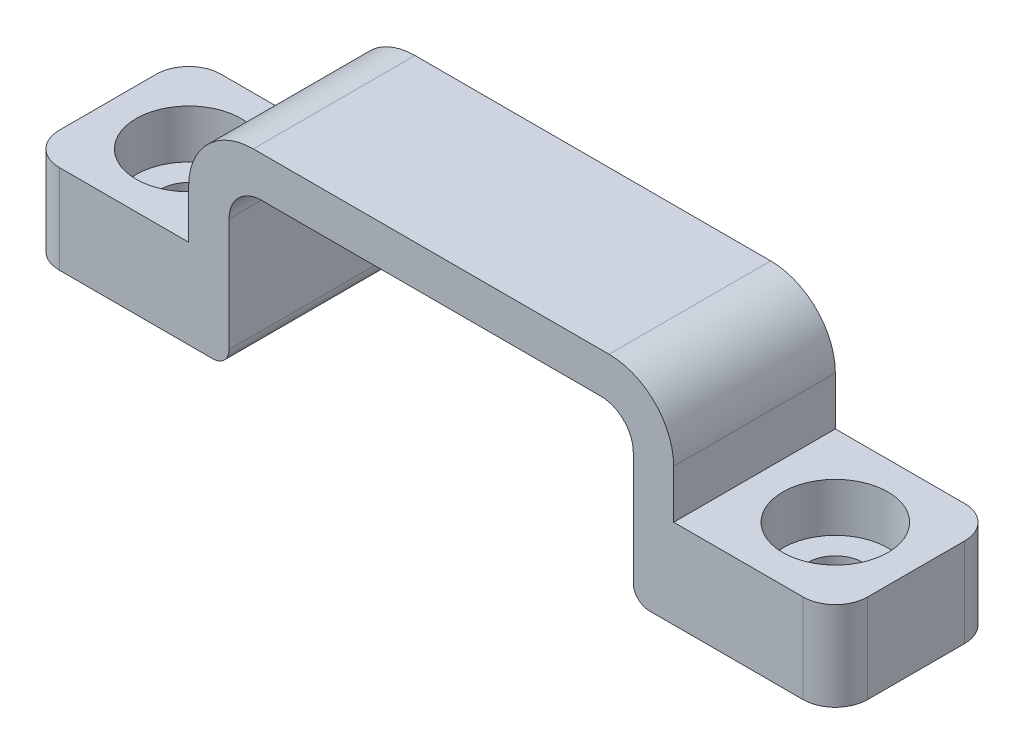
ISO-10303-21;
HEADER;
FILE_DESCRIPTION(('STEP AP214'),'2;1');
FILE_NAME('part.step','',(''),(''),'','','');
FILE_SCHEMA(('AUTOMOTIVE_DESIGN { 1 0 10303 214 1 1 1 1 }'));
ENDSEC;
DATA;
#1=APPLICATION_CONTEXT('core data for automotive mechanical design processes');
#2=APPLICATION_PROTOCOL_DEFINITION('international standard','automotive_design',2000,#1);
#3=PRODUCT_CONTEXT('',#1,'mechanical');
#4=PRODUCT('Part','Part','',(#3));
#5=PRODUCT_RELATED_PRODUCT_CATEGORY('part','',(#4));
#6=PRODUCT_DEFINITION_FORMATION('','',#4);
#7=PRODUCT_DEFINITION_CONTEXT('part definition',#1,'design');
#8=PRODUCT_DEFINITION('design','',#6,#7);
#9=PRODUCT_DEFINITION_SHAPE('','',#8);
#10=(LENGTH_UNIT() NAMED_UNIT(*) SI_UNIT(.MILLI.,.METRE.));
#11=(NAMED_UNIT(*) PLANE_ANGLE_UNIT() SI_UNIT($,.RADIAN.));
#12=(NAMED_UNIT(*) SI_UNIT($,.STERADIAN.) SOLID_ANGLE_UNIT());
#13=UNCERTAINTY_MEASURE_WITH_UNIT(LENGTH_MEASURE(1.E-05),#10,'distance_accuracy_value','');
#14=(GEOMETRIC_REPRESENTATION_CONTEXT(3) GLOBAL_UNCERTAINTY_ASSIGNED_CONTEXT((#13)) GLOBAL_UNIT_ASSIGNED_CONTEXT((#10,
#11,#12)) REPRESENTATION_CONTEXT('',''));
#15=CARTESIAN_POINT('',(0.,0.,0.));
#16=DIRECTION('',(0.,0.,1.));
#17=DIRECTION('',(1.,0.,0.));
#18=AXIS2_PLACEMENT_3D('',#15,#16,#17);
#19=CARTESIAN_POINT('',(15.,2.5,5.));
#20=DIRECTION('',(-1.,0.,0.));
#21=DIRECTION('',(0.,0.,1.));
#22=AXIS2_PLACEMENT_3D('',#19,#20,#21);
#23=PLANE('',#22);
#24=DIRECTION('',(0.,1.,0.));
#25=VECTOR('',#24,1.);
#26=CARTESIAN_POINT('',(15.,2.5,-5.));
#27=LINE('',#26,#25);
#28=CARTESIAN_POINT('',(15.,-4.5,-5.));
#29=VERTEX_POINT('',#28);
#30=CARTESIAN_POINT('',(15.,-1.5,-5.));
#31=VERTEX_POINT('',#30);
#32=EDGE_CURVE('E237',#29,#31,#27,.T.);
#33=ORIENTED_EDGE('',*,*,#32,.T.);
#34=DIRECTION('',(0.,0.,-1.));
#35=VECTOR('',#34,1.);
#36=CARTESIAN_POINT('',(15.,-1.5,5.));
#37=LINE('',#36,#35);
#38=CARTESIAN_POINT('',(15.,-1.5,5.));
#39=VERTEX_POINT('',#38);
#40=EDGE_CURVE('E308',#31,#39,#37,.F.);
#41=ORIENTED_EDGE('',*,*,#40,.T.);
#42=DIRECTION('',(0.,1.,0.));
#43=VECTOR('',#42,1.);
#44=CARTESIAN_POINT('',(15.,2.5,5.));
#45=LINE('',#44,#43);
#46=CARTESIAN_POINT('',(15.,-4.5,5.));
#47=VERTEX_POINT('',#46);
#48=EDGE_CURVE('E261',#47,#39,#45,.T.);
#49=ORIENTED_EDGE('',*,*,#48,.F.);
#50=DIRECTION('',(0.,0.,-1.));
#51=VECTOR('',#50,1.);
#52=CARTESIAN_POINT('',(15.,-4.5,5.));
#53=LINE('',#52,#51);
#54=EDGE_CURVE('E236',#47,#29,#53,.T.);
#55=ORIENTED_EDGE('',*,*,#54,.T.);
#56=EDGE_LOOP('',(#33,#41,#49,#55));
#57=FACE_BOUND('',#56,.T.);
#58=ADVANCED_FACE('F41',(#57),#23,.F.);
#59=CARTESIAN_POINT('',(-15.,2.5,5.));
#60=DIRECTION('',(0.,-1.,0.));
#61=DIRECTION('',(0.,0.,-1.));
#62=AXIS2_PLACEMENT_3D('',#59,#60,#61);
#63=PLANE('',#62);
#64=DIRECTION('',(-1.,0.,0.));
#65=VECTOR('',#64,1.);
#66=CARTESIAN_POINT('',(-15.,2.5,-5.));
#67=LINE('',#66,#65);
#68=CARTESIAN_POINT('',(11.,2.5,-5.));
#69=VERTEX_POINT('',#68);
#70=CARTESIAN_POINT('',(-11.,2.5,-5.));
#71=VERTEX_POINT('',#70);
#72=EDGE_CURVE('E240',#69,#71,#67,.T.);
#73=ORIENTED_EDGE('',*,*,#72,.T.);
#74=DIRECTION('',(0.,0.,-1.));
#75=VECTOR('',#74,1.);
#76=CARTESIAN_POINT('',(-11.,2.5,5.));
#77=LINE('',#76,#75);
#78=CARTESIAN_POINT('',(-11.,2.5,5.));
#79=VERTEX_POINT('',#78);
#80=EDGE_CURVE('E303',#71,#79,#77,.F.);
#81=ORIENTED_EDGE('',*,*,#80,.T.);
#82=DIRECTION('',(-1.,0.,0.));
#83=VECTOR('',#82,1.);
#84=CARTESIAN_POINT('',(-15.,2.5,5.));
#85=LINE('',#84,#83);
#86=CARTESIAN_POINT('',(11.,2.5,5.));
#87=VERTEX_POINT('',#86);
#88=EDGE_CURVE('E203',#87,#79,#85,.T.);
#89=ORIENTED_EDGE('',*,*,#88,.F.);
#90=DIRECTION('',(0.,0.,-1.));
#91=VECTOR('',#90,1.);
#92=CARTESIAN_POINT('',(11.,2.5,5.));
#93=LINE('',#92,#91);
#94=EDGE_CURVE('E300',#87,#69,#93,.T.);
#95=ORIENTED_EDGE('',*,*,#94,.T.);
#96=EDGE_LOOP('',(#73,#81,#89,#95));
#97=FACE_BOUND('',#96,.T.);
#98=ADVANCED_FACE('F432',(#97),#63,.F.);
#99=CARTESIAN_POINT('',(-15.,2.5,5.));
#100=DIRECTION('',(1.,0.,0.));
#101=DIRECTION('',(0.,0.,-1.));
#102=AXIS2_PLACEMENT_3D('',#99,#100,#101);
#103=PLANE('',#102);
#104=DIRECTION('',(0.,-1.,0.));
#105=VECTOR('',#104,1.);
#106=CARTESIAN_POINT('',(-15.,2.5,5.));
#107=LINE('',#106,#105);
#108=CARTESIAN_POINT('',(-15.,-1.5,5.));
#109=VERTEX_POINT('',#108);
#110=CARTESIAN_POINT('',(-15.,-4.5,5.));
#111=VERTEX_POINT('',#110);
#112=EDGE_CURVE('E189',#109,#111,#107,.T.);
#113=ORIENTED_EDGE('',*,*,#112,.F.);
#114=DIRECTION('',(0.,0.,-1.));
#115=VECTOR('',#114,1.);
#116=CARTESIAN_POINT('',(-15.,-1.5,5.));
#117=LINE('',#116,#115);
#118=CARTESIAN_POINT('',(-15.,-1.5,-5.));
#119=VERTEX_POINT('',#118);
#120=EDGE_CURVE('E294',#109,#119,#117,.T.);
#121=ORIENTED_EDGE('',*,*,#120,.T.);
#122=DIRECTION('',(0.,-1.,0.));
#123=VECTOR('',#122,1.);
#124=CARTESIAN_POINT('',(-15.,2.5,-5.));
#125=LINE('',#124,#123);
#126=CARTESIAN_POINT('',(-15.,-4.5,-5.));
#127=VERTEX_POINT('',#126);
#128=EDGE_CURVE('E209',#119,#127,#125,.T.);
#129=ORIENTED_EDGE('',*,*,#128,.T.);
#130=DIRECTION('',(0.,0.,-1.));
#131=VECTOR('',#130,1.);
#132=CARTESIAN_POINT('',(-15.,-4.5,5.));
#133=LINE('',#132,#131);
#134=EDGE_CURVE('E206',#111,#127,#133,.T.);
#135=ORIENTED_EDGE('',*,*,#134,.F.);
#136=EDGE_LOOP('',(#113,#121,#129,#135));
#137=FACE_BOUND('',#136,.T.);
#138=ADVANCED_FACE('F207',(#137),#103,.F.);
#139=CARTESIAN_POINT('',(-15.,-4.5,5.));
#140=DIRECTION('',(0.,-1.,0.));
#141=DIRECTION('',(1.,0.,0.));
#142=AXIS2_PLACEMENT_3D('',#139,#140,#141);
#143=PLANE('',#142);
#144=CARTESIAN_POINT('',(-20.,-4.5,0.));
#145=DIRECTION('',(0.,1.,0.));
#146=DIRECTION('',(0.,0.,1.));
#147=AXIS2_PLACEMENT_3D('',#144,#145,#146);
#148=CIRCLE('',#147,3.25);
#149=CARTESIAN_POINT('',(-20.,-4.5,3.25));
#150=VERTEX_POINT('',#149);
#151=EDGE_CURVE('E414',#150,#150,#148,.T.);
#152=ORIENTED_EDGE('',*,*,#151,.F.);
#153=EDGE_LOOP('',(#152));
#154=FACE_BOUND('',#153,.T.);
#155=DIRECTION('',(-1.,0.,0.));
#156=VECTOR('',#155,1.);
#157=CARTESIAN_POINT('',(-15.,-4.5,-5.));
#158=LINE('',#157,#156);
#159=CARTESIAN_POINT('',(-23.,-4.5,-5.));
#160=VERTEX_POINT('',#159);
#161=EDGE_CURVE('E245',#127,#160,#158,.T.);
#162=ORIENTED_EDGE('',*,*,#161,.T.);
#163=CARTESIAN_POINT('',(-23.,-4.5,-3.));
#164=DIRECTION('',(0.,-1.,0.));
#165=DIRECTION('',(1.,0.,0.));
#166=AXIS2_PLACEMENT_3D('',#163,#164,#165);
#167=CIRCLE('',#166,2.);
#168=CARTESIAN_POINT('',(-25.,-4.5,-3.));
#169=VERTEX_POINT('',#168);
#170=EDGE_CURVE('E325',#160,#169,#167,.F.);
#171=ORIENTED_EDGE('',*,*,#170,.T.);
#172=DIRECTION('',(0.,0.,-1.));
#173=VECTOR('',#172,1.);
#174=CARTESIAN_POINT('',(-25.,-4.5,5.));
#175=LINE('',#174,#173);
#176=CARTESIAN_POINT('',(-25.,-4.5,3.));
#177=VERTEX_POINT('',#176);
#178=EDGE_CURVE('E214',#177,#169,#175,.T.);
#179=ORIENTED_EDGE('',*,*,#178,.F.);
#180=CARTESIAN_POINT('',(-23.,-4.5,3.));
#181=DIRECTION('',(0.,-1.,0.));
#182=DIRECTION('',(1.,0.,0.));
#183=AXIS2_PLACEMENT_3D('',#180,#181,#182);
#184=CIRCLE('',#183,2.);
#185=CARTESIAN_POINT('',(-23.,-4.5,5.));
#186=VERTEX_POINT('',#185);
#187=EDGE_CURVE('E219',#177,#186,#184,.F.);
#188=ORIENTED_EDGE('',*,*,#187,.T.);
#189=DIRECTION('',(-1.,0.,0.));
#190=VECTOR('',#189,1.);
#191=CARTESIAN_POINT('',(-15.,-4.5,5.));
#192=LINE('',#191,#190);
#193=EDGE_CURVE('E195',#111,#186,#192,.T.);
#194=ORIENTED_EDGE('',*,*,#193,.F.);
#195=ORIENTED_EDGE('',*,*,#134,.T.);
#196=EDGE_LOOP('',(#162,#171,#179,#188,#194,#195));
#197=FACE_BOUND('',#196,.T.);
#198=ADVANCED_FACE('F216',(#154,#197),#143,.F.);
#199=CARTESIAN_POINT('',(-25.,-4.5,5.));
#200=DIRECTION('',(1.,0.,0.));
#201=DIRECTION('',(0.,0.,-1.));
#202=AXIS2_PLACEMENT_3D('',#199,#200,#201);
#203=PLANE('',#202);
#204=ORIENTED_EDGE('',*,*,#178,.T.);
#205=DIRECTION('',(0.,-1.,0.));
#206=VECTOR('',#205,1.);
#207=CARTESIAN_POINT('',(-25.,-4.5,-3.));
#208=LINE('',#207,#206);
#209=CARTESIAN_POINT('',(-25.,-10.,-3.));
#210=VERTEX_POINT('',#209);
#211=EDGE_CURVE('E312',#169,#210,#208,.T.);
#212=ORIENTED_EDGE('',*,*,#211,.T.);
#213=DIRECTION('',(0.,0.,-1.));
#214=VECTOR('',#213,1.);
#215=CARTESIAN_POINT('',(-25.,-10.,5.));
#216=LINE('',#215,#214);
#217=CARTESIAN_POINT('',(-25.,-10.,3.));
#218=VERTEX_POINT('',#217);
#219=EDGE_CURVE('E270',#218,#210,#216,.T.);
#220=ORIENTED_EDGE('',*,*,#219,.F.);
#221=DIRECTION('',(0.,-1.,0.));
#222=VECTOR('',#221,1.);
#223=CARTESIAN_POINT('',(-25.,-4.5,3.));
#224=LINE('',#223,#222);
#225=EDGE_CURVE('E310',#218,#177,#224,.F.);
#226=ORIENTED_EDGE('',*,*,#225,.T.);
#227=EDGE_LOOP('',(#204,#212,#220,#226));
#228=FACE_BOUND('',#227,.T.);
#229=ADVANCED_FACE('F421',(#228),#203,.F.);
#230=CARTESIAN_POINT('',(-15.,-10.,5.));
#231=DIRECTION('',(0.,1.,0.));
#232=DIRECTION('',(-1.,0.,0.));
#233=AXIS2_PLACEMENT_3D('',#230,#231,#232);
#234=PLANE('',#233);
#235=CARTESIAN_POINT('',(-20.,-10.,0.));
#236=DIRECTION('',(0.,1.,0.));
#237=DIRECTION('',(0.,0.,1.));
#238=AXIS2_PLACEMENT_3D('',#235,#236,#237);
#239=CIRCLE('',#238,1.7);
#240=CARTESIAN_POINT('',(-20.,-10.,1.7));
#241=VERTEX_POINT('',#240);
#242=EDGE_CURVE('E405',#241,#241,#239,.T.);
#243=ORIENTED_EDGE('',*,*,#242,.T.);
#244=EDGE_LOOP('',(#243));
#245=FACE_BOUND('',#244,.T.);
#246=DIRECTION('',(1.,0.,0.));
#247=VECTOR('',#246,1.);
#248=CARTESIAN_POINT('',(-15.,-10.,-5.));
#249=LINE('',#248,#247);
#250=CARTESIAN_POINT('',(-23.,-9.99999999999999,-5.));
#251=VERTEX_POINT('',#250);
#252=CARTESIAN_POINT('',(-13.5,-10.,-5.));
#253=VERTEX_POINT('',#252);
#254=EDGE_CURVE('E247',#251,#253,#249,.T.);
#255=ORIENTED_EDGE('',*,*,#254,.T.);
#256=DIRECTION('',(0.,0.,-1.));
#257=VECTOR('',#256,1.);
#258=CARTESIAN_POINT('',(-13.5,-10.,5.));
#259=LINE('',#258,#257);
#260=CARTESIAN_POINT('',(-13.5,-10.,5.));
#261=VERTEX_POINT('',#260);
#262=EDGE_CURVE('E353',#253,#261,#259,.F.);
#263=ORIENTED_EDGE('',*,*,#262,.T.);
#264=DIRECTION('',(1.,0.,0.));
#265=VECTOR('',#264,1.);
#266=CARTESIAN_POINT('',(-15.,-10.,5.));
#267=LINE('',#266,#265);
#268=CARTESIAN_POINT('',(-23.,-10.,5.));
#269=VERTEX_POINT('',#268);
#270=EDGE_CURVE('E220',#269,#261,#267,.T.);
#271=ORIENTED_EDGE('',*,*,#270,.F.);
#272=CARTESIAN_POINT('',(-23.,-9.99999999999999,3.));
#273=DIRECTION('',(0.,1.,0.));
#274=DIRECTION('',(-1.,0.,0.));
#275=AXIS2_PLACEMENT_3D('',#272,#273,#274);
#276=CIRCLE('',#275,2.);
#277=EDGE_CURVE('E315',#269,#218,#276,.F.);
#278=ORIENTED_EDGE('',*,*,#277,.T.);
#279=ORIENTED_EDGE('',*,*,#219,.T.);
#280=CARTESIAN_POINT('',(-23.,-9.99999999999999,-3.));
#281=DIRECTION('',(0.,1.,0.));
#282=DIRECTION('',(-1.,0.,0.));
#283=AXIS2_PLACEMENT_3D('',#280,#281,#282);
#284=CIRCLE('',#283,2.);
#285=EDGE_CURVE('E317',#210,#251,#284,.F.);
#286=ORIENTED_EDGE('',*,*,#285,.T.);
#287=EDGE_LOOP('',(#255,#263,#271,#278,#279,#286));
#288=FACE_BOUND('',#287,.T.);
#289=ADVANCED_FACE('F428',(#245,#288),#234,.F.);
#290=CARTESIAN_POINT('',(-12.5,-10.,5.));
#291=DIRECTION('',(-1.,0.,0.));
#292=DIRECTION('',(0.,0.,1.));
#293=AXIS2_PLACEMENT_3D('',#290,#291,#292);
#294=PLANE('',#293);
#295=DIRECTION('',(0.,1.,0.));
#296=VECTOR('',#295,1.);
#297=CARTESIAN_POINT('',(-12.5,-10.,5.));
#298=LINE('',#297,#296);
#299=CARTESIAN_POINT('',(-12.5,-9.,5.));
#300=VERTEX_POINT('',#299);
#301=CARTESIAN_POINT('',(-12.5,-2.,5.));
#302=VERTEX_POINT('',#301);
#303=EDGE_CURVE('E222',#300,#302,#298,.T.);
#304=ORIENTED_EDGE('',*,*,#303,.F.);
#305=DIRECTION('',(0.,0.,-1.));
#306=VECTOR('',#305,1.);
#307=CARTESIAN_POINT('',(-12.5,-9.,5.));
#308=LINE('',#307,#306);
#309=CARTESIAN_POINT('',(-12.5,-9.,-5.));
#310=VERTEX_POINT('',#309);
#311=EDGE_CURVE('E346',#300,#310,#308,.T.);
#312=ORIENTED_EDGE('',*,*,#311,.T.);
#313=DIRECTION('',(0.,1.,0.));
#314=VECTOR('',#313,1.);
#315=CARTESIAN_POINT('',(-12.5,-10.,-5.));
#316=LINE('',#315,#314);
#317=CARTESIAN_POINT('',(-12.5,-2.,-5.));
#318=VERTEX_POINT('',#317);
#319=EDGE_CURVE('E250',#310,#318,#316,.T.);
#320=ORIENTED_EDGE('',*,*,#319,.T.);
#321=DIRECTION('',(0.,0.,-1.));
#322=VECTOR('',#321,1.);
#323=CARTESIAN_POINT('',(-12.5,-2.,5.));
#324=LINE('',#323,#322);
#325=EDGE_CURVE('E279',#318,#302,#324,.F.);
#326=ORIENTED_EDGE('',*,*,#325,.T.);
#327=EDGE_LOOP('',(#304,#312,#320,#326));
#328=FACE_BOUND('',#327,.T.);
#329=ADVANCED_FACE('F482',(#328),#294,.F.);
#330=CARTESIAN_POINT('',(-12.5,0.,5.));
#331=DIRECTION('',(0.,1.,0.));
#332=DIRECTION('',(0.,0.,1.));
#333=AXIS2_PLACEMENT_3D('',#330,#331,#332);
#334=PLANE('',#333);
#335=DIRECTION('',(1.,0.,0.));
#336=VECTOR('',#335,1.);
#337=CARTESIAN_POINT('',(-12.5,0.,5.));
#338=LINE('',#337,#336);
#339=CARTESIAN_POINT('',(-10.5,0.,5.));
#340=VERTEX_POINT('',#339);
#341=CARTESIAN_POINT('',(10.5,0.,5.));
#342=VERTEX_POINT('',#341);
#343=EDGE_CURVE('E227',#340,#342,#338,.T.);
#344=ORIENTED_EDGE('',*,*,#343,.F.);
#345=DIRECTION('',(0.,0.,-1.));
#346=VECTOR('',#345,1.);
#347=CARTESIAN_POINT('',(-10.5,0.,-5.));
#348=LINE('',#347,#346);
#349=CARTESIAN_POINT('',(-10.5,0.,-5.));
#350=VERTEX_POINT('',#349);
#351=EDGE_CURVE('E276',#340,#350,#348,.T.);
#352=ORIENTED_EDGE('',*,*,#351,.T.);
#353=DIRECTION('',(1.,0.,0.));
#354=VECTOR('',#353,1.);
#355=CARTESIAN_POINT('',(-12.5,0.,-5.));
#356=LINE('',#355,#354);
#357=CARTESIAN_POINT('',(10.5,0.,-5.));
#358=VERTEX_POINT('',#357);
#359=EDGE_CURVE('E252',#350,#358,#356,.T.);
#360=ORIENTED_EDGE('',*,*,#359,.T.);
#361=DIRECTION('',(0.,0.,-1.));
#362=VECTOR('',#361,1.);
#363=CARTESIAN_POINT('',(10.5,0.,5.));
#364=LINE('',#363,#362);
#365=EDGE_CURVE('E213',#358,#342,#364,.F.);
#366=ORIENTED_EDGE('',*,*,#365,.T.);
#367=EDGE_LOOP('',(#344,#352,#360,#366));
#368=FACE_BOUND('',#367,.T.);
#369=ADVANCED_FACE('F489',(#368),#334,.F.);
#370=CARTESIAN_POINT('',(12.5,-10.,5.));
#371=DIRECTION('',(1.,0.,0.));
#372=DIRECTION('',(0.,0.,-1.));
#373=AXIS2_PLACEMENT_3D('',#370,#371,#372);
#374=PLANE('',#373);
#375=DIRECTION('',(0.,-1.,0.));
#376=VECTOR('',#375,1.);
#377=CARTESIAN_POINT('',(12.5,-10.,-5.));
#378=LINE('',#377,#376);
#379=CARTESIAN_POINT('',(12.5,-2.,-5.));
#380=VERTEX_POINT('',#379);
#381=CARTESIAN_POINT('',(12.5,-9.,-5.));
#382=VERTEX_POINT('',#381);
#383=EDGE_CURVE('E255',#380,#382,#378,.T.);
#384=ORIENTED_EDGE('',*,*,#383,.T.);
#385=DIRECTION('',(0.,0.,-1.));
#386=VECTOR('',#385,1.);
#387=CARTESIAN_POINT('',(12.5,-9.,5.));
#388=LINE('',#387,#386);
#389=CARTESIAN_POINT('',(12.5,-9.,5.));
#390=VERTEX_POINT('',#389);
#391=EDGE_CURVE('E11',#382,#390,#388,.F.);
#392=ORIENTED_EDGE('',*,*,#391,.T.);
#393=DIRECTION('',(0.,-1.,0.));
#394=VECTOR('',#393,1.);
#395=CARTESIAN_POINT('',(12.5,-10.,5.));
#396=LINE('',#395,#394);
#397=CARTESIAN_POINT('',(12.5,-2.,5.));
#398=VERTEX_POINT('',#397);
#399=EDGE_CURVE('E230',#398,#390,#396,.T.);
#400=ORIENTED_EDGE('',*,*,#399,.F.);
#401=DIRECTION('',(0.,0.,-1.));
#402=VECTOR('',#401,1.);
#403=CARTESIAN_POINT('',(12.5,-2.,-5.));
#404=LINE('',#403,#402);
#405=EDGE_CURVE('E282',#398,#380,#404,.T.);
#406=ORIENTED_EDGE('',*,*,#405,.T.);
#407=EDGE_LOOP('',(#384,#392,#400,#406));
#408=FACE_BOUND('',#407,.T.);
#409=ADVANCED_FACE('F493',(#408),#374,.F.);
#410=CARTESIAN_POINT('',(15.,-10.,5.));
#411=DIRECTION('',(0.,1.,0.));
#412=DIRECTION('',(-1.,0.,0.));
#413=AXIS2_PLACEMENT_3D('',#410,#411,#412);
#414=PLANE('',#413);
#415=CARTESIAN_POINT('',(20.,-10.,0.));
#416=DIRECTION('',(0.,1.,0.));
#417=DIRECTION('',(0.,0.,1.));
#418=AXIS2_PLACEMENT_3D('',#415,#416,#417);
#419=CIRCLE('',#418,1.7);
#420=CARTESIAN_POINT('',(20.,-10.,1.7));
#421=VERTEX_POINT('',#420);
#422=EDGE_CURVE('E241',#421,#421,#419,.T.);
#423=ORIENTED_EDGE('',*,*,#422,.T.);
#424=EDGE_LOOP('',(#423));
#425=FACE_BOUND('',#424,.T.);
#426=DIRECTION('',(1.,0.,0.));
#427=VECTOR('',#426,1.);
#428=CARTESIAN_POINT('',(15.,-10.,5.));
#429=LINE('',#428,#427);
#430=CARTESIAN_POINT('',(13.5,-10.,5.));
#431=VERTEX_POINT('',#430);
#432=CARTESIAN_POINT('',(23.,-9.99999999999999,5.));
#433=VERTEX_POINT('',#432);
#434=EDGE_CURVE('E232',#431,#433,#429,.T.);
#435=ORIENTED_EDGE('',*,*,#434,.F.);
#436=DIRECTION('',(0.,0.,-1.));
#437=VECTOR('',#436,1.);
#438=CARTESIAN_POINT('',(13.5,-10.,5.));
#439=LINE('',#438,#437);
#440=CARTESIAN_POINT('',(13.5,-10.,-5.));
#441=VERTEX_POINT('',#440);
#442=EDGE_CURVE('E49',#431,#441,#439,.T.);
#443=ORIENTED_EDGE('',*,*,#442,.T.);
#444=DIRECTION('',(1.,0.,0.));
#445=VECTOR('',#444,1.);
#446=CARTESIAN_POINT('',(15.,-10.,-5.));
#447=LINE('',#446,#445);
#448=CARTESIAN_POINT('',(23.,-10.,-5.));
#449=VERTEX_POINT('',#448);
#450=EDGE_CURVE('E257',#441,#449,#447,.T.);
#451=ORIENTED_EDGE('',*,*,#450,.T.);
#452=CARTESIAN_POINT('',(23.,-10.,-3.));
#453=DIRECTION('',(0.,1.,0.));
#454=DIRECTION('',(-1.,0.,0.));
#455=AXIS2_PLACEMENT_3D('',#452,#453,#454);
#456=CIRCLE('',#455,2.);
#457=CARTESIAN_POINT('',(25.,-10.,-3.));
#458=VERTEX_POINT('',#457);
#459=EDGE_CURVE('E344',#449,#458,#456,.F.);
#460=ORIENTED_EDGE('',*,*,#459,.T.);
#461=DIRECTION('',(0.,0.,-1.));
#462=VECTOR('',#461,1.);
#463=CARTESIAN_POINT('',(25.,-10.,5.));
#464=LINE('',#463,#462);
#465=CARTESIAN_POINT('',(25.,-10.,3.));
#466=VERTEX_POINT('',#465);
#467=EDGE_CURVE('E267',#466,#458,#464,.T.);
#468=ORIENTED_EDGE('',*,*,#467,.F.);
#469=CARTESIAN_POINT('',(23.,-10.,3.));
#470=DIRECTION('',(0.,1.,0.));
#471=DIRECTION('',(-1.,0.,0.));
#472=AXIS2_PLACEMENT_3D('',#469,#470,#471);
#473=CIRCLE('',#472,2.);
#474=EDGE_CURVE('E341',#466,#433,#473,.F.);
#475=ORIENTED_EDGE('',*,*,#474,.T.);
#476=EDGE_LOOP('',(#435,#443,#451,#460,#468,#475));
#477=FACE_BOUND('',#476,.T.);
#478=ADVANCED_FACE('F361',(#425,#477),#414,.F.);
#479=CARTESIAN_POINT('',(25.,-4.5,5.));
#480=DIRECTION('',(-1.,0.,0.));
#481=DIRECTION('',(0.,0.,1.));
#482=AXIS2_PLACEMENT_3D('',#479,#480,#481);
#483=PLANE('',#482);
#484=ORIENTED_EDGE('',*,*,#467,.T.);
#485=DIRECTION('',(0.,1.,0.));
#486=VECTOR('',#485,1.);
#487=CARTESIAN_POINT('',(25.,-4.5,-3.));
#488=LINE('',#487,#486);
#489=CARTESIAN_POINT('',(25.,-4.5,-3.));
#490=VERTEX_POINT('',#489);
#491=EDGE_CURVE('E334',#458,#490,#488,.T.);
#492=ORIENTED_EDGE('',*,*,#491,.T.);
#493=DIRECTION('',(0.,0.,-1.));
#494=VECTOR('',#493,1.);
#495=CARTESIAN_POINT('',(25.,-4.5,5.));
#496=LINE('',#495,#494);
#497=CARTESIAN_POINT('',(25.,-4.5,3.));
#498=VERTEX_POINT('',#497);
#499=EDGE_CURVE('E264',#498,#490,#496,.T.);
#500=ORIENTED_EDGE('',*,*,#499,.F.);
#501=DIRECTION('',(0.,1.,0.));
#502=VECTOR('',#501,1.);
#503=CARTESIAN_POINT('',(25.,-10.,3.));
#504=LINE('',#503,#502);
#505=EDGE_CURVE('E332',#498,#466,#504,.F.);
#506=ORIENTED_EDGE('',*,*,#505,.T.);
#507=EDGE_LOOP('',(#484,#492,#500,#506));
#508=FACE_BOUND('',#507,.T.);
#509=ADVANCED_FACE('F377',(#508),#483,.F.);
#510=CARTESIAN_POINT('',(15.,-4.5,5.));
#511=DIRECTION('',(0.,-1.,0.));
#512=DIRECTION('',(1.,0.,0.));
#513=AXIS2_PLACEMENT_3D('',#510,#511,#512);
#514=PLANE('',#513);
#515=CARTESIAN_POINT('',(20.,-4.5,0.));
#516=DIRECTION('',(0.,1.,0.));
#517=DIRECTION('',(0.,0.,1.));
#518=AXIS2_PLACEMENT_3D('',#515,#516,#517);
#519=CIRCLE('',#518,3.25);
#520=CARTESIAN_POINT('',(20.,-4.5,3.25));
#521=VERTEX_POINT('',#520);
#522=EDGE_CURVE('E402',#521,#521,#519,.T.);
#523=ORIENTED_EDGE('',*,*,#522,.F.);
#524=EDGE_LOOP('',(#523));
#525=FACE_BOUND('',#524,.T.);
#526=ORIENTED_EDGE('',*,*,#499,.T.);
#527=CARTESIAN_POINT('',(23.,-4.5,-3.));
#528=DIRECTION('',(0.,-1.,0.));
#529=DIRECTION('',(1.,0.,0.));
#530=AXIS2_PLACEMENT_3D('',#527,#528,#529);
#531=CIRCLE('',#530,2.);
#532=CARTESIAN_POINT('',(23.,-4.5,-5.));
#533=VERTEX_POINT('',#532);
#534=EDGE_CURVE('E339',#490,#533,#531,.F.);
#535=ORIENTED_EDGE('',*,*,#534,.T.);
#536=DIRECTION('',(-1.,0.,0.));
#537=VECTOR('',#536,1.);
#538=CARTESIAN_POINT('',(15.,-4.5,-5.));
#539=LINE('',#538,#537);
#540=EDGE_CURVE('E259',#533,#29,#539,.T.);
#541=ORIENTED_EDGE('',*,*,#540,.T.);
#542=ORIENTED_EDGE('',*,*,#54,.F.);
#543=DIRECTION('',(-1.,0.,0.));
#544=VECTOR('',#543,1.);
#545=CARTESIAN_POINT('',(15.,-4.5,5.));
#546=LINE('',#545,#544);
#547=CARTESIAN_POINT('',(23.,-4.5,5.));
#548=VERTEX_POINT('',#547);
#549=EDGE_CURVE('E234',#548,#47,#546,.T.);
#550=ORIENTED_EDGE('',*,*,#549,.F.);
#551=CARTESIAN_POINT('',(23.,-4.5,3.));
#552=DIRECTION('',(0.,-1.,0.));
#553=DIRECTION('',(1.,0.,0.));
#554=AXIS2_PLACEMENT_3D('',#551,#552,#553);
#555=CIRCLE('',#554,2.);
#556=EDGE_CURVE('E337',#548,#498,#555,.F.);
#557=ORIENTED_EDGE('',*,*,#556,.T.);
#558=EDGE_LOOP('',(#526,#535,#541,#542,#550,#557));
#559=FACE_BOUND('',#558,.T.);
#560=ADVANCED_FACE('F387',(#525,#559),#514,.F.);
#561=CARTESIAN_POINT('',(0.,0.,5.));
#562=DIRECTION('',(0.,0.,1.));
#563=DIRECTION('',(1.,0.,0.));
#564=AXIS2_PLACEMENT_3D('',#561,#562,#563);
#565=PLANE('',#564);
#566=ORIENTED_EDGE('',*,*,#270,.T.);
#567=CARTESIAN_POINT('',(-13.5,-9.,5.));
#568=DIRECTION('',(0.,0.,1.));
#569=DIRECTION('',(1.,0.,0.));
#570=AXIS2_PLACEMENT_3D('',#567,#568,#569);
#571=CIRCLE('',#570,1.);
#572=EDGE_CURVE('E356',#261,#300,#571,.T.);
#573=ORIENTED_EDGE('',*,*,#572,.T.);
#574=ORIENTED_EDGE('',*,*,#303,.T.);
#575=CARTESIAN_POINT('',(-10.5,-2.,5.));
#576=DIRECTION('',(0.,0.,1.));
#577=DIRECTION('',(1.,0.,0.));
#578=AXIS2_PLACEMENT_3D('',#575,#576,#577);
#579=CIRCLE('',#578,2.);
#580=EDGE_CURVE('E288',#302,#340,#579,.F.);
#581=ORIENTED_EDGE('',*,*,#580,.T.);
#582=ORIENTED_EDGE('',*,*,#343,.T.);
#583=CARTESIAN_POINT('',(10.5,-2.,5.));
#584=DIRECTION('',(0.,0.,1.));
#585=DIRECTION('',(1.,0.,0.));
#586=AXIS2_PLACEMENT_3D('',#583,#584,#585);
#587=CIRCLE('',#586,2.);
#588=EDGE_CURVE('E292',#342,#398,#587,.F.);
#589=ORIENTED_EDGE('',*,*,#588,.T.);
#590=ORIENTED_EDGE('',*,*,#399,.T.);
#591=CARTESIAN_POINT('',(13.5,-9.,5.));
#592=DIRECTION('',(0.,0.,1.));
#593=DIRECTION('',(1.,0.,0.));
#594=AXIS2_PLACEMENT_3D('',#591,#592,#593);
#595=CIRCLE('',#594,1.);
#596=EDGE_CURVE('E56',#390,#431,#595,.T.);
#597=ORIENTED_EDGE('',*,*,#596,.T.);
#598=ORIENTED_EDGE('',*,*,#434,.T.);
#599=DIRECTION('',(0.,1.,0.));
#600=VECTOR('',#599,1.);
#601=CARTESIAN_POINT('',(23.,-4.5,5.));
#602=LINE('',#601,#600);
#603=EDGE_CURVE('E327',#433,#548,#602,.T.);
#604=ORIENTED_EDGE('',*,*,#603,.T.);
#605=ORIENTED_EDGE('',*,*,#549,.T.);
#606=ORIENTED_EDGE('',*,*,#48,.T.);
#607=CARTESIAN_POINT('',(11.,-1.5,5.));
#608=DIRECTION('',(0.,0.,1.));
#609=DIRECTION('',(1.,0.,0.));
#610=AXIS2_PLACEMENT_3D('',#607,#608,#609);
#611=CIRCLE('',#610,4.);
#612=EDGE_CURVE('E305',#39,#87,#611,.T.);
#613=ORIENTED_EDGE('',*,*,#612,.T.);
#614=ORIENTED_EDGE('',*,*,#88,.T.);
#615=CARTESIAN_POINT('',(-11.,-1.5,5.));
#616=DIRECTION('',(0.,0.,1.));
#617=DIRECTION('',(1.,0.,0.));
#618=AXIS2_PLACEMENT_3D('',#615,#616,#617);
#619=CIRCLE('',#618,4.);
#620=EDGE_CURVE('E199',#79,#109,#619,.T.);
#621=ORIENTED_EDGE('',*,*,#620,.T.);
#622=ORIENTED_EDGE('',*,*,#112,.T.);
#623=ORIENTED_EDGE('',*,*,#193,.T.);
#624=DIRECTION('',(0.,-1.,0.));
#625=VECTOR('',#624,1.);
#626=CARTESIAN_POINT('',(-23.,-10.,5.));
#627=LINE('',#626,#625);
#628=EDGE_CURVE('E330',#186,#269,#627,.T.);
#629=ORIENTED_EDGE('',*,*,#628,.T.);
#630=EDGE_LOOP('',(#566,#573,#574,#581,#582,#589,#590,#597,#598,#604,#605,#606,#613,#614,#621,
#622,#623,#629));
#631=FACE_BOUND('',#630,.T.);
#632=ADVANCED_FACE('F192',(#631),#565,.T.);
#633=CARTESIAN_POINT('',(0.,0.,-5.));
#634=DIRECTION('',(0.,0.,1.));
#635=DIRECTION('',(1.,0.,0.));
#636=AXIS2_PLACEMENT_3D('',#633,#634,#635);
#637=PLANE('',#636);
#638=ORIENTED_EDGE('',*,*,#319,.F.);
#639=CARTESIAN_POINT('',(-13.5,-9.,-5.));
#640=DIRECTION('',(0.,0.,1.));
#641=DIRECTION('',(1.,0.,0.));
#642=AXIS2_PLACEMENT_3D('',#639,#640,#641);
#643=CIRCLE('',#642,1.);
#644=EDGE_CURVE('E351',#310,#253,#643,.F.);
#645=ORIENTED_EDGE('',*,*,#644,.T.);
#646=ORIENTED_EDGE('',*,*,#254,.F.);
#647=DIRECTION('',(0.,-1.,0.));
#648=VECTOR('',#647,1.);
#649=CARTESIAN_POINT('',(-23.,0.,-5.));
#650=LINE('',#649,#648);
#651=EDGE_CURVE('E322',#251,#160,#650,.F.);
#652=ORIENTED_EDGE('',*,*,#651,.T.);
#653=ORIENTED_EDGE('',*,*,#161,.F.);
#654=ORIENTED_EDGE('',*,*,#128,.F.);
#655=CARTESIAN_POINT('',(-11.,-1.5,-5.));
#656=DIRECTION('',(0.,0.,1.));
#657=DIRECTION('',(1.,0.,0.));
#658=AXIS2_PLACEMENT_3D('',#655,#656,#657);
#659=CIRCLE('',#658,4.);
#660=EDGE_CURVE('E298',#119,#71,#659,.F.);
#661=ORIENTED_EDGE('',*,*,#660,.T.);
#662=ORIENTED_EDGE('',*,*,#72,.F.);
#663=CARTESIAN_POINT('',(11.,-1.5,-5.));
#664=DIRECTION('',(0.,0.,1.));
#665=DIRECTION('',(1.,0.,0.));
#666=AXIS2_PLACEMENT_3D('',#663,#664,#665);
#667=CIRCLE('',#666,4.);
#668=EDGE_CURVE('E296',#69,#31,#667,.F.);
#669=ORIENTED_EDGE('',*,*,#668,.T.);
#670=ORIENTED_EDGE('',*,*,#32,.F.);
#671=ORIENTED_EDGE('',*,*,#540,.F.);
#672=DIRECTION('',(0.,1.,0.));
#673=VECTOR('',#672,1.);
#674=CARTESIAN_POINT('',(23.,0.,-5.));
#675=LINE('',#674,#673);
#676=EDGE_CURVE('E319',#533,#449,#675,.F.);
#677=ORIENTED_EDGE('',*,*,#676,.T.);
#678=ORIENTED_EDGE('',*,*,#450,.F.);
#679=CARTESIAN_POINT('',(13.5,-9.,-5.));
#680=DIRECTION('',(0.,0.,1.));
#681=DIRECTION('',(1.,0.,0.));
#682=AXIS2_PLACEMENT_3D('',#679,#680,#681);
#683=CIRCLE('',#682,1.);
#684=EDGE_CURVE('E349',#441,#382,#683,.F.);
#685=ORIENTED_EDGE('',*,*,#684,.T.);
#686=ORIENTED_EDGE('',*,*,#383,.F.);
#687=CARTESIAN_POINT('',(10.5,-2.,-5.));
#688=DIRECTION('',(0.,0.,1.));
#689=DIRECTION('',(1.,0.,0.));
#690=AXIS2_PLACEMENT_3D('',#687,#688,#689);
#691=CIRCLE('',#690,2.);
#692=EDGE_CURVE('E290',#380,#358,#691,.T.);
#693=ORIENTED_EDGE('',*,*,#692,.T.);
#694=ORIENTED_EDGE('',*,*,#359,.F.);
#695=CARTESIAN_POINT('',(-10.5,-2.,-5.));
#696=DIRECTION('',(0.,0.,1.));
#697=DIRECTION('',(1.,0.,0.));
#698=AXIS2_PLACEMENT_3D('',#695,#696,#697);
#699=CIRCLE('',#698,2.);
#700=EDGE_CURVE('E285',#350,#318,#699,.T.);
#701=ORIENTED_EDGE('',*,*,#700,.T.);
#702=EDGE_LOOP('',(#638,#645,#646,#652,#653,#654,#661,#662,#669,#670,#671,#677,#678,#685,#686,
#693,#694,#701));
#703=FACE_BOUND('',#702,.T.);
#704=ADVANCED_FACE('F365',(#703),#637,.F.);
#705=CARTESIAN_POINT('',(-10.5,-2.,5.));
#706=DIRECTION('',(0.,0.,1.));
#707=DIRECTION('',(1.,0.,0.));
#708=AXIS2_PLACEMENT_3D('',#705,#706,#707);
#709=CYLINDRICAL_SURFACE('',#708,2.);
#710=ORIENTED_EDGE('',*,*,#580,.F.);
#711=ORIENTED_EDGE('',*,*,#325,.F.);
#712=ORIENTED_EDGE('',*,*,#700,.F.);
#713=ORIENTED_EDGE('',*,*,#351,.F.);
#714=EDGE_LOOP('',(#710,#711,#712,#713));
#715=FACE_BOUND('',#714,.T.);
#716=ADVANCED_FACE('F443',(#715),#709,.F.);
#717=CARTESIAN_POINT('',(10.5,-2.,5.));
#718=DIRECTION('',(0.,0.,1.));
#719=DIRECTION('',(1.,0.,0.));
#720=AXIS2_PLACEMENT_3D('',#717,#718,#719);
#721=CYLINDRICAL_SURFACE('',#720,2.);
#722=ORIENTED_EDGE('',*,*,#588,.F.);
#723=ORIENTED_EDGE('',*,*,#365,.F.);
#724=ORIENTED_EDGE('',*,*,#692,.F.);
#725=ORIENTED_EDGE('',*,*,#405,.F.);
#726=EDGE_LOOP('',(#722,#723,#724,#725));
#727=FACE_BOUND('',#726,.T.);
#728=ADVANCED_FACE('F446',(#727),#721,.F.);
#729=CARTESIAN_POINT('',(-11.,-1.5,5.));
#730=DIRECTION('',(0.,0.,-1.));
#731=DIRECTION('',(-1.,0.,0.));
#732=AXIS2_PLACEMENT_3D('',#729,#730,#731);
#733=CYLINDRICAL_SURFACE('',#732,4.);
#734=ORIENTED_EDGE('',*,*,#620,.F.);
#735=ORIENTED_EDGE('',*,*,#80,.F.);
#736=ORIENTED_EDGE('',*,*,#660,.F.);
#737=ORIENTED_EDGE('',*,*,#120,.F.);
#738=EDGE_LOOP('',(#734,#735,#736,#737));
#739=FACE_BOUND('',#738,.T.);
#740=ADVANCED_FACE('F449',(#739),#733,.T.);
#741=CARTESIAN_POINT('',(11.,-1.5,5.));
#742=DIRECTION('',(0.,0.,-1.));
#743=DIRECTION('',(-1.,0.,0.));
#744=AXIS2_PLACEMENT_3D('',#741,#742,#743);
#745=CYLINDRICAL_SURFACE('',#744,4.);
#746=ORIENTED_EDGE('',*,*,#612,.F.);
#747=ORIENTED_EDGE('',*,*,#40,.F.);
#748=ORIENTED_EDGE('',*,*,#668,.F.);
#749=ORIENTED_EDGE('',*,*,#94,.F.);
#750=EDGE_LOOP('',(#746,#747,#748,#749));
#751=FACE_BOUND('',#750,.T.);
#752=ADVANCED_FACE('F453',(#751),#745,.T.);
#753=CARTESIAN_POINT('',(-23.,-4.5,-3.));
#754=DIRECTION('',(0.,-1.,0.));
#755=DIRECTION('',(0.,0.,-1.));
#756=AXIS2_PLACEMENT_3D('',#753,#754,#755);
#757=CYLINDRICAL_SURFACE('',#756,2.);
#758=ORIENTED_EDGE('',*,*,#170,.F.);
#759=ORIENTED_EDGE('',*,*,#651,.F.);
#760=ORIENTED_EDGE('',*,*,#285,.F.);
#761=ORIENTED_EDGE('',*,*,#211,.F.);
#762=EDGE_LOOP('',(#758,#759,#760,#761));
#763=FACE_BOUND('',#762,.T.);
#764=ADVANCED_FACE('F457',(#763),#757,.T.);
#765=CARTESIAN_POINT('',(-23.,0.,3.));
#766=DIRECTION('',(0.,1.,0.));
#767=DIRECTION('',(0.,0.,1.));
#768=AXIS2_PLACEMENT_3D('',#765,#766,#767);
#769=CYLINDRICAL_SURFACE('',#768,2.);
#770=ORIENTED_EDGE('',*,*,#187,.F.);
#771=ORIENTED_EDGE('',*,*,#225,.F.);
#772=ORIENTED_EDGE('',*,*,#277,.F.);
#773=ORIENTED_EDGE('',*,*,#628,.F.);
#774=EDGE_LOOP('',(#770,#771,#772,#773));
#775=FACE_BOUND('',#774,.T.);
#776=ADVANCED_FACE('F461',(#775),#769,.T.);
#777=CARTESIAN_POINT('',(23.,-4.5,-3.));
#778=DIRECTION('',(0.,1.,0.));
#779=DIRECTION('',(0.,0.,1.));
#780=AXIS2_PLACEMENT_3D('',#777,#778,#779);
#781=CYLINDRICAL_SURFACE('',#780,2.);
#782=ORIENTED_EDGE('',*,*,#459,.F.);
#783=ORIENTED_EDGE('',*,*,#676,.F.);
#784=ORIENTED_EDGE('',*,*,#534,.F.);
#785=ORIENTED_EDGE('',*,*,#491,.F.);
#786=EDGE_LOOP('',(#782,#783,#784,#785));
#787=FACE_BOUND('',#786,.T.);
#788=ADVANCED_FACE('F373',(#787),#781,.T.);
#789=CARTESIAN_POINT('',(23.,0.,3.));
#790=DIRECTION('',(0.,-1.,0.));
#791=DIRECTION('',(0.,0.,-1.));
#792=AXIS2_PLACEMENT_3D('',#789,#790,#791);
#793=CYLINDRICAL_SURFACE('',#792,2.);
#794=ORIENTED_EDGE('',*,*,#474,.F.);
#795=ORIENTED_EDGE('',*,*,#505,.F.);
#796=ORIENTED_EDGE('',*,*,#556,.F.);
#797=ORIENTED_EDGE('',*,*,#603,.F.);
#798=EDGE_LOOP('',(#794,#795,#796,#797));
#799=FACE_BOUND('',#798,.T.);
#800=ADVANCED_FACE('F381',(#799),#793,.T.);
#801=CARTESIAN_POINT('',(-13.5,-9.,5.));
#802=DIRECTION('',(0.,0.,-1.));
#803=DIRECTION('',(-1.,0.,0.));
#804=AXIS2_PLACEMENT_3D('',#801,#802,#803);
#805=CYLINDRICAL_SURFACE('',#804,1.);
#806=ORIENTED_EDGE('',*,*,#572,.F.);
#807=ORIENTED_EDGE('',*,*,#262,.F.);
#808=ORIENTED_EDGE('',*,*,#644,.F.);
#809=ORIENTED_EDGE('',*,*,#311,.F.);
#810=EDGE_LOOP('',(#806,#807,#808,#809));
#811=FACE_BOUND('',#810,.T.);
#812=ADVANCED_FACE('F469',(#811),#805,.T.);
#813=CARTESIAN_POINT('',(13.5,-9.,5.));
#814=DIRECTION('',(0.,0.,-1.));
#815=DIRECTION('',(-1.,0.,0.));
#816=AXIS2_PLACEMENT_3D('',#813,#814,#815);
#817=CYLINDRICAL_SURFACE('',#816,1.);
#818=ORIENTED_EDGE('',*,*,#596,.F.);
#819=ORIENTED_EDGE('',*,*,#391,.F.);
#820=ORIENTED_EDGE('',*,*,#684,.F.);
#821=ORIENTED_EDGE('',*,*,#442,.F.);
#822=EDGE_LOOP('',(#818,#819,#820,#821));
#823=FACE_BOUND('',#822,.T.);
#824=ADVANCED_FACE('F43',(#823),#817,.T.);
#825=CARTESIAN_POINT('',(20.,-4.5,0.));
#826=DIRECTION('',(0.,1.,0.));
#827=DIRECTION('',(0.,0.,1.));
#828=AXIS2_PLACEMENT_3D('',#825,#826,#827);
#829=CYLINDRICAL_SURFACE('',#828,1.7);
#830=ORIENTED_EDGE('',*,*,#422,.F.);
#831=EDGE_LOOP('',(#830));
#832=FACE_BOUND('',#831,.T.);
#833=CARTESIAN_POINT('',(20.,-7.5,0.));
#834=DIRECTION('',(0.,1.,0.));
#835=DIRECTION('',(0.,0.,1.));
#836=AXIS2_PLACEMENT_3D('',#833,#834,#835);
#837=CIRCLE('',#836,1.70000000000001);
#838=CARTESIAN_POINT('',(20.,-7.5,1.70000000000001));
#839=VERTEX_POINT('',#838);
#840=EDGE_CURVE('E396',#839,#839,#837,.T.);
#841=ORIENTED_EDGE('',*,*,#840,.T.);
#842=EDGE_LOOP('',(#841));
#843=FACE_BOUND('',#842,.T.);
#844=ADVANCED_FACE('F475',(#832,#843),#829,.F.);
#845=CARTESIAN_POINT('',(21.7,-7.5,0.));
#846=DIRECTION('',(0.,-1.,0.));
#847=DIRECTION('',(0.,0.,-1.));
#848=AXIS2_PLACEMENT_3D('',#845,#846,#847);
#849=PLANE('',#848);
#850=ORIENTED_EDGE('',*,*,#840,.F.);
#851=EDGE_LOOP('',(#850));
#852=FACE_BOUND('',#851,.T.);
#853=CARTESIAN_POINT('',(20.,-7.5,0.));
#854=DIRECTION('',(0.,1.,0.));
#855=DIRECTION('',(0.,0.,1.));
#856=AXIS2_PLACEMENT_3D('',#853,#854,#855);
#857=CIRCLE('',#856,3.25);
#858=CARTESIAN_POINT('',(20.,-7.5,3.25));
#859=VERTEX_POINT('',#858);
#860=EDGE_CURVE('E399',#859,#859,#857,.T.);
#861=ORIENTED_EDGE('',*,*,#860,.T.);
#862=EDGE_LOOP('',(#861));
#863=FACE_BOUND('',#862,.T.);
#864=ADVANCED_FACE('F529',(#852,#863),#849,.F.);
#865=CARTESIAN_POINT('',(20.,-4.5,0.));
#866=DIRECTION('',(0.,1.,0.));
#867=DIRECTION('',(0.,0.,1.));
#868=AXIS2_PLACEMENT_3D('',#865,#866,#867);
#869=CYLINDRICAL_SURFACE('',#868,3.25);
#870=ORIENTED_EDGE('',*,*,#860,.F.);
#871=EDGE_LOOP('',(#870));
#872=FACE_BOUND('',#871,.T.);
#873=ORIENTED_EDGE('',*,*,#522,.T.);
#874=EDGE_LOOP('',(#873));
#875=FACE_BOUND('',#874,.T.);
#876=ADVANCED_FACE('F533',(#872,#875),#869,.F.);
#877=CARTESIAN_POINT('',(-20.,-4.5,0.));
#878=DIRECTION('',(0.,1.,0.));
#879=DIRECTION('',(0.,0.,1.));
#880=AXIS2_PLACEMENT_3D('',#877,#878,#879);
#881=CYLINDRICAL_SURFACE('',#880,1.7);
#882=ORIENTED_EDGE('',*,*,#242,.F.);
#883=EDGE_LOOP('',(#882));
#884=FACE_BOUND('',#883,.T.);
#885=CARTESIAN_POINT('',(-20.,-7.5,0.));
#886=DIRECTION('',(0.,1.,0.));
#887=DIRECTION('',(0.,0.,1.));
#888=AXIS2_PLACEMENT_3D('',#885,#886,#887);
#889=CIRCLE('',#888,1.70000000000001);
#890=CARTESIAN_POINT('',(-20.,-7.5,1.70000000000001));
#891=VERTEX_POINT('',#890);
#892=EDGE_CURVE('E408',#891,#891,#889,.T.);
#893=ORIENTED_EDGE('',*,*,#892,.T.);
#894=EDGE_LOOP('',(#893));
#895=FACE_BOUND('',#894,.T.);
#896=ADVANCED_FACE('F537',(#884,#895),#881,.F.);
#897=CARTESIAN_POINT('',(-18.3,-7.5,0.));
#898=DIRECTION('',(0.,-1.,0.));
#899=DIRECTION('',(0.,0.,-1.));
#900=AXIS2_PLACEMENT_3D('',#897,#898,#899);
#901=PLANE('',#900);
#902=ORIENTED_EDGE('',*,*,#892,.F.);
#903=EDGE_LOOP('',(#902));
#904=FACE_BOUND('',#903,.T.);
#905=CARTESIAN_POINT('',(-20.,-7.5,0.));
#906=DIRECTION('',(0.,1.,0.));
#907=DIRECTION('',(0.,0.,1.));
#908=AXIS2_PLACEMENT_3D('',#905,#906,#907);
#909=CIRCLE('',#908,3.25);
#910=CARTESIAN_POINT('',(-20.,-7.5,3.25));
#911=VERTEX_POINT('',#910);
#912=EDGE_CURVE('E411',#911,#911,#909,.T.);
#913=ORIENTED_EDGE('',*,*,#912,.T.);
#914=EDGE_LOOP('',(#913));
#915=FACE_BOUND('',#914,.T.);
#916=ADVANCED_FACE('F541',(#904,#915),#901,.F.);
#917=CARTESIAN_POINT('',(-20.,-4.5,0.));
#918=DIRECTION('',(0.,1.,0.));
#919=DIRECTION('',(0.,0.,1.));
#920=AXIS2_PLACEMENT_3D('',#917,#918,#919);
#921=CYLINDRICAL_SURFACE('',#920,3.25);
#922=ORIENTED_EDGE('',*,*,#912,.F.);
#923=EDGE_LOOP('',(#922));
#924=FACE_BOUND('',#923,.T.);
#925=ORIENTED_EDGE('',*,*,#151,.T.);
#926=EDGE_LOOP('',(#925));
#927=FACE_BOUND('',#926,.T.);
#928=ADVANCED_FACE('F418',(#924,#927),#921,.F.);
#929=CLOSED_SHELL('',(#58,#98,#138,#198,#229,#289,#329,#369,#409,#478,#509,#560,#632,#704,#716,
#728,#740,#752,#764,#776,#788,#800,#812,#824,#844,#864,#876,#896,#916,#928));
#930=MANIFOLD_SOLID_BREP('B2',#929);
#931=ADVANCED_BREP_SHAPE_REPRESENTATION('',(#18,#930),#14);
#932=SHAPE_DEFINITION_REPRESENTATION(#9,#931);
ENDSEC;
END-ISO-10303-21;
